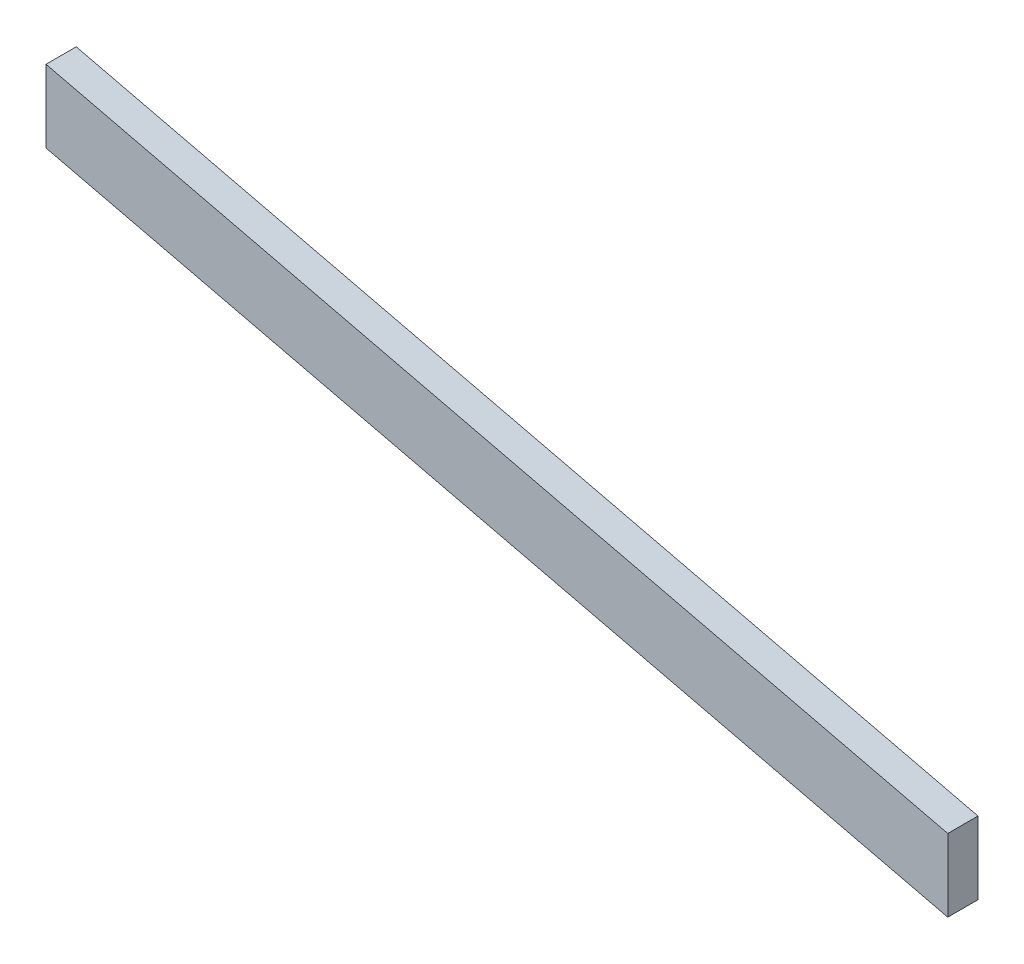
ISO-10303-21;
HEADER;
FILE_DESCRIPTION(('STEP AP214'),'2;1');
FILE_NAME('part.step','',(''),(''),'','','');
FILE_SCHEMA(('AUTOMOTIVE_DESIGN { 1 0 10303 214 1 1 1 1 }'));
ENDSEC;
DATA;
#1=APPLICATION_CONTEXT('core data for automotive mechanical design processes');
#2=APPLICATION_PROTOCOL_DEFINITION('international standard','automotive_design',2000,#1);
#3=PRODUCT_CONTEXT('',#1,'mechanical');
#4=PRODUCT('Part','Part','',(#3));
#5=PRODUCT_RELATED_PRODUCT_CATEGORY('part','',(#4));
#6=PRODUCT_DEFINITION_FORMATION('','',#4);
#7=PRODUCT_DEFINITION_CONTEXT('part definition',#1,'design');
#8=PRODUCT_DEFINITION('design','',#6,#7);
#9=PRODUCT_DEFINITION_SHAPE('','',#8);
#10=(LENGTH_UNIT() NAMED_UNIT(*) SI_UNIT(.MILLI.,.METRE.));
#11=(NAMED_UNIT(*) PLANE_ANGLE_UNIT() SI_UNIT($,.RADIAN.));
#12=(NAMED_UNIT(*) SI_UNIT($,.STERADIAN.) SOLID_ANGLE_UNIT());
#13=UNCERTAINTY_MEASURE_WITH_UNIT(LENGTH_MEASURE(1.E-05),#10,'distance_accuracy_value','');
#14=(GEOMETRIC_REPRESENTATION_CONTEXT(3) GLOBAL_UNCERTAINTY_ASSIGNED_CONTEXT((#13)) GLOBAL_UNIT_ASSIGNED_CONTEXT((#10,
#11,#12)) REPRESENTATION_CONTEXT('',''));
#15=CARTESIAN_POINT('',(0.,0.,0.));
#16=DIRECTION('',(0.,0.,1.));
#17=DIRECTION('',(1.,0.,0.));
#18=AXIS2_PLACEMENT_3D('',#15,#16,#17);
#19=CARTESIAN_POINT('',(-190.793434472433,66.7260500937795,38.1));
#20=DIRECTION('',(1.,0.,0.));
#21=DIRECTION('',(0.,1.,0.));
#22=AXIS2_PLACEMENT_3D('',#19,#20,#21);
#23=PLANE('',#22);
#24=DIRECTION('',(0.,-1.,0.));
#25=VECTOR('',#24,1.);
#26=CARTESIAN_POINT('',(-190.793434472433,66.7260500937795,0.));
#27=LINE('',#26,#25);
#28=CARTESIAN_POINT('',(-190.793434472433,158.12412093598,0.));
#29=VERTEX_POINT('',#28);
#30=CARTESIAN_POINT('',(-190.793434472433,66.7260500937795,0.));
#31=VERTEX_POINT('',#30);
#32=EDGE_CURVE('E95',#29,#31,#27,.T.);
#33=ORIENTED_EDGE('',*,*,#32,.T.);
#34=DIRECTION('',(0.,0.,-1.));
#35=VECTOR('',#34,1.);
#36=CARTESIAN_POINT('',(-190.793434472433,66.7260500937795,38.1));
#37=LINE('',#36,#35);
#38=CARTESIAN_POINT('',(-190.793434472433,66.7260500937795,38.1));
#39=VERTEX_POINT('',#38);
#40=EDGE_CURVE('E11',#39,#31,#37,.T.);
#41=ORIENTED_EDGE('',*,*,#40,.F.);
#42=DIRECTION('',(0.,-1.,0.));
#43=VECTOR('',#42,1.);
#44=CARTESIAN_POINT('',(-190.793434472433,66.7260500937795,38.1));
#45=LINE('',#44,#43);
#46=CARTESIAN_POINT('',(-190.793434472433,158.12412093598,38.1));
#47=VERTEX_POINT('',#46);
#48=EDGE_CURVE('E83',#47,#39,#45,.T.);
#49=ORIENTED_EDGE('',*,*,#48,.F.);
#50=DIRECTION('',(0.,0.,-1.));
#51=VECTOR('',#50,1.);
#52=CARTESIAN_POINT('',(-190.793434472433,158.12412093598,38.1));
#53=LINE('',#52,#51);
#54=EDGE_CURVE('E91',#47,#29,#53,.T.);
#55=ORIENTED_EDGE('',*,*,#54,.T.);
#56=EDGE_LOOP('',(#33,#41,#49,#55));
#57=FACE_BOUND('',#56,.T.);
#58=ADVANCED_FACE('F32',(#57),#23,.F.);
#59=CARTESIAN_POINT('',(945.856565527566,-204.61962906402,38.1));
#60=DIRECTION('',(0.232199289212662,0.972668232281251,0.));
#61=DIRECTION('',(-0.972668232281251,0.232199289212662,0.));
#62=AXIS2_PLACEMENT_3D('',#59,#60,#61);
#63=PLANE('',#62);
#64=DIRECTION('',(0.972668232281251,-0.232199289212662,0.));
#65=VECTOR('',#64,1.);
#66=CARTESIAN_POINT('',(945.856565527566,-204.61962906402,0.));
#67=LINE('',#66,#65);
#68=CARTESIAN_POINT('',(945.856565527566,-204.61962906402,0.));
#69=VERTEX_POINT('',#68);
#70=EDGE_CURVE('E87',#31,#69,#67,.T.);
#71=ORIENTED_EDGE('',*,*,#70,.T.);
#72=DIRECTION('',(0.,0.,-1.));
#73=VECTOR('',#72,1.);
#74=CARTESIAN_POINT('',(945.856565527566,-204.61962906402,38.1));
#75=LINE('',#74,#73);
#76=CARTESIAN_POINT('',(945.856565527566,-204.61962906402,38.1));
#77=VERTEX_POINT('',#76);
#78=EDGE_CURVE('E40',#77,#69,#75,.T.);
#79=ORIENTED_EDGE('',*,*,#78,.F.);
#80=DIRECTION('',(0.972668232281251,-0.232199289212662,0.));
#81=VECTOR('',#80,1.);
#82=CARTESIAN_POINT('',(945.856565527566,-204.61962906402,38.1));
#83=LINE('',#82,#81);
#84=EDGE_CURVE('E78',#39,#77,#83,.T.);
#85=ORIENTED_EDGE('',*,*,#84,.F.);
#86=ORIENTED_EDGE('',*,*,#40,.T.);
#87=EDGE_LOOP('',(#71,#79,#85,#86));
#88=FACE_BOUND('',#87,.T.);
#89=ADVANCED_FACE('F86',(#88),#63,.F.);
#90=CARTESIAN_POINT('',(945.856565527564,-113.221558221819,38.1));
#91=DIRECTION('',(-1.,0.,0.));
#92=DIRECTION('',(0.,-1.,0.));
#93=AXIS2_PLACEMENT_3D('',#90,#91,#92);
#94=PLANE('',#93);
#95=DIRECTION('',(0.,1.,0.));
#96=VECTOR('',#95,1.);
#97=CARTESIAN_POINT('',(945.856565527564,-113.221558221819,0.));
#98=LINE('',#97,#96);
#99=CARTESIAN_POINT('',(945.856565527564,-113.221558221819,0.));
#100=VERTEX_POINT('',#99);
#101=EDGE_CURVE('E65',#69,#100,#98,.T.);
#102=ORIENTED_EDGE('',*,*,#101,.T.);
#103=DIRECTION('',(0.,0.,-1.));
#104=VECTOR('',#103,1.);
#105=CARTESIAN_POINT('',(945.856565527564,-113.221558221819,38.1));
#106=LINE('',#105,#104);
#107=CARTESIAN_POINT('',(945.856565527564,-113.221558221819,38.1));
#108=VERTEX_POINT('',#107);
#109=EDGE_CURVE('E88',#108,#100,#106,.T.);
#110=ORIENTED_EDGE('',*,*,#109,.F.);
#111=DIRECTION('',(0.,1.,0.));
#112=VECTOR('',#111,1.);
#113=CARTESIAN_POINT('',(945.856565527564,-113.221558221819,38.1));
#114=LINE('',#113,#112);
#115=EDGE_CURVE('E81',#77,#108,#114,.T.);
#116=ORIENTED_EDGE('',*,*,#115,.F.);
#117=ORIENTED_EDGE('',*,*,#78,.T.);
#118=EDGE_LOOP('',(#102,#110,#116,#117));
#119=FACE_BOUND('',#118,.T.);
#120=ADVANCED_FACE('F89',(#119),#94,.F.);
#121=CARTESIAN_POINT('',(-190.793434472433,158.12412093598,38.1));
#122=DIRECTION('',(-0.232199289212662,-0.972668232281251,0.));
#123=DIRECTION('',(0.972668232281252,-0.232199289212662,0.));
#124=AXIS2_PLACEMENT_3D('',#121,#122,#123);
#125=PLANE('',#124);
#126=DIRECTION('',(-0.972668232281251,0.232199289212662,0.));
#127=VECTOR('',#126,1.);
#128=CARTESIAN_POINT('',(-190.793434472433,158.12412093598,0.));
#129=LINE('',#128,#127);
#130=EDGE_CURVE('E71',#100,#29,#129,.T.);
#131=ORIENTED_EDGE('',*,*,#130,.T.);
#132=ORIENTED_EDGE('',*,*,#54,.F.);
#133=DIRECTION('',(-0.972668232281251,0.232199289212662,0.));
#134=VECTOR('',#133,1.);
#135=CARTESIAN_POINT('',(-190.793434472433,158.12412093598,38.1));
#136=LINE('',#135,#134);
#137=EDGE_CURVE('E48',#108,#47,#136,.T.);
#138=ORIENTED_EDGE('',*,*,#137,.F.);
#139=ORIENTED_EDGE('',*,*,#109,.T.);
#140=EDGE_LOOP('',(#131,#132,#138,#139));
#141=FACE_BOUND('',#140,.T.);
#142=ADVANCED_FACE('F102',(#141),#125,.F.);
#143=CARTESIAN_POINT('',(0.,0.,38.1));
#144=DIRECTION('',(0.,0.,-1.));
#145=DIRECTION('',(-1.,0.,0.));
#146=AXIS2_PLACEMENT_3D('',#143,#144,#145);
#147=PLANE('',#146);
#148=ORIENTED_EDGE('',*,*,#48,.T.);
#149=ORIENTED_EDGE('',*,*,#84,.T.);
#150=ORIENTED_EDGE('',*,*,#115,.T.);
#151=ORIENTED_EDGE('',*,*,#137,.T.);
#152=EDGE_LOOP('',(#148,#149,#150,#151));
#153=FACE_BOUND('',#152,.T.);
#154=ADVANCED_FACE('F79',(#153),#147,.F.);
#155=CARTESIAN_POINT('',(0.,0.,0.));
#156=DIRECTION('',(0.,0.,-1.));
#157=DIRECTION('',(-1.,0.,0.));
#158=AXIS2_PLACEMENT_3D('',#155,#156,#157);
#159=PLANE('',#158);
#160=ORIENTED_EDGE('',*,*,#32,.F.);
#161=ORIENTED_EDGE('',*,*,#130,.F.);
#162=ORIENTED_EDGE('',*,*,#101,.F.);
#163=ORIENTED_EDGE('',*,*,#70,.F.);
#164=EDGE_LOOP('',(#160,#161,#162,#163));
#165=FACE_BOUND('',#164,.T.);
#166=ADVANCED_FACE('F105',(#165),#159,.T.);
#167=CLOSED_SHELL('',(#58,#89,#120,#142,#154,#166));
#168=MANIFOLD_SOLID_BREP('B2',#167);
#169=ADVANCED_BREP_SHAPE_REPRESENTATION('',(#18,#168),#14);
#170=SHAPE_DEFINITION_REPRESENTATION(#9,#169);
ENDSEC;
END-ISO-10303-21;
